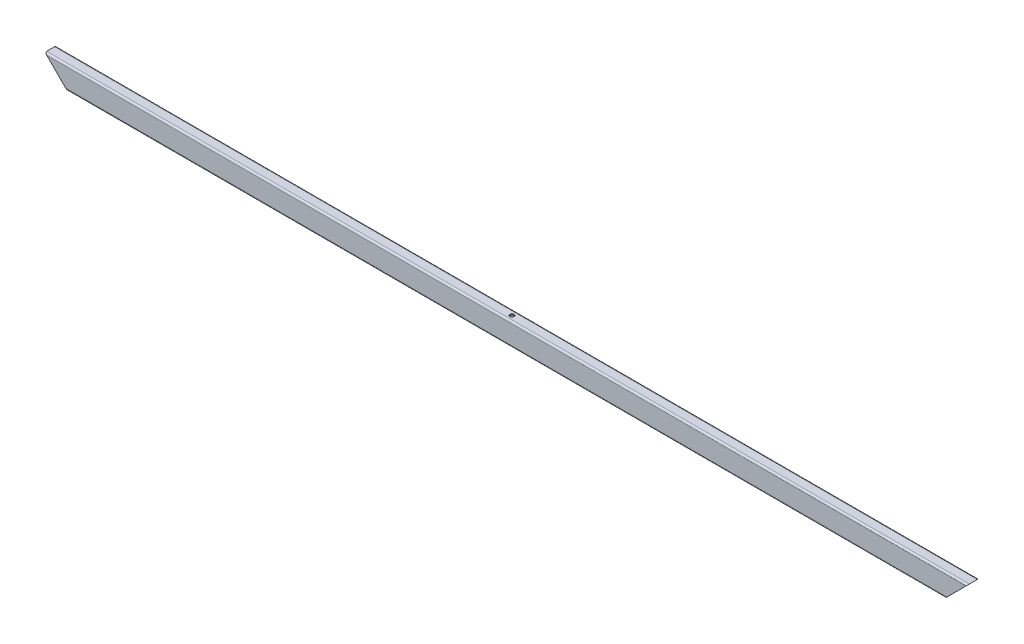
ISO-10303-21;
HEADER;
FILE_DESCRIPTION(('STEP AP214'),'2;1');
FILE_NAME('part.step','',(''),(''),'','','');
FILE_SCHEMA(('AUTOMOTIVE_DESIGN { 1 0 10303 214 1 1 1 1 }'));
ENDSEC;
DATA;
#1=APPLICATION_CONTEXT('core data for automotive mechanical design processes');
#2=APPLICATION_PROTOCOL_DEFINITION('international standard','automotive_design',2000,#1);
#3=PRODUCT_CONTEXT('',#1,'mechanical');
#4=PRODUCT('Part','Part','',(#3));
#5=PRODUCT_RELATED_PRODUCT_CATEGORY('part','',(#4));
#6=PRODUCT_DEFINITION_FORMATION('','',#4);
#7=PRODUCT_DEFINITION_CONTEXT('part definition',#1,'design');
#8=PRODUCT_DEFINITION('design','',#6,#7);
#9=PRODUCT_DEFINITION_SHAPE('','',#8);
#10=(LENGTH_UNIT() NAMED_UNIT(*) SI_UNIT(.MILLI.,.METRE.));
#11=(NAMED_UNIT(*) PLANE_ANGLE_UNIT() SI_UNIT($,.RADIAN.));
#12=(NAMED_UNIT(*) SI_UNIT($,.STERADIAN.) SOLID_ANGLE_UNIT());
#13=UNCERTAINTY_MEASURE_WITH_UNIT(LENGTH_MEASURE(1.E-05),#10,'distance_accuracy_value','');
#14=(GEOMETRIC_REPRESENTATION_CONTEXT(3) GLOBAL_UNCERTAINTY_ASSIGNED_CONTEXT((#13)) GLOBAL_UNIT_ASSIGNED_CONTEXT((#10,
#11,#12)) REPRESENTATION_CONTEXT('',''));
#15=CARTESIAN_POINT('',(0.,0.,0.));
#16=DIRECTION('',(0.,0.,1.));
#17=DIRECTION('',(1.,0.,0.));
#18=AXIS2_PLACEMENT_3D('',#15,#16,#17);
#19=CARTESIAN_POINT('',(801.999999999999,1104.,112.));
#20=DIRECTION('',(0.,1.,0.));
#21=DIRECTION('',(-1.,0.,0.));
#22=AXIS2_PLACEMENT_3D('',#19,#20,#21);
#23=PLANE('',#22);
#24=CARTESIAN_POINT('',(400.,1104.,119.));
#25=DIRECTION('',(0.,-1.,0.));
#26=DIRECTION('',(0.,0.,-1.));
#27=AXIS2_PLACEMENT_3D('',#24,#25,#26);
#28=CIRCLE('',#27,1.64999999999998);
#29=CARTESIAN_POINT('',(400.,1104.,117.35));
#30=VERTEX_POINT('',#29);
#31=EDGE_CURVE('E245',#30,#30,#28,.T.);
#32=ORIENTED_EDGE('',*,*,#31,.F.);
#33=EDGE_LOOP('',(#32));
#34=FACE_BOUND('',#33,.T.);
#35=CARTESIAN_POINT('',(150.,1104.,119.));
#36=DIRECTION('',(0.,-1.,0.));
#37=DIRECTION('',(0.,0.,-1.));
#38=AXIS2_PLACEMENT_3D('',#35,#36,#37);
#39=CIRCLE('',#38,1.65000000000001);
#40=CARTESIAN_POINT('',(150.,1104.,117.35));
#41=VERTEX_POINT('',#40);
#42=EDGE_CURVE('E235',#41,#41,#39,.T.);
#43=ORIENTED_EDGE('',*,*,#42,.F.);
#44=EDGE_LOOP('',(#43));
#45=FACE_BOUND('',#44,.T.);
#46=CARTESIAN_POINT('',(650.,1104.,119.));
#47=DIRECTION('',(0.,-1.,0.));
#48=DIRECTION('',(0.,0.,-1.));
#49=AXIS2_PLACEMENT_3D('',#46,#47,#48);
#50=CIRCLE('',#49,1.65000000000004);
#51=CARTESIAN_POINT('',(650.,1104.,117.35));
#52=VERTEX_POINT('',#51);
#53=EDGE_CURVE('E229',#52,#52,#50,.T.);
#54=ORIENTED_EDGE('',*,*,#53,.F.);
#55=EDGE_LOOP('',(#54));
#56=FACE_BOUND('',#55,.T.);
#57=CARTESIAN_POINT('',(-650.,1104.,119.));
#58=DIRECTION('',(0.,-1.,0.));
#59=DIRECTION('',(0.,0.,-1.));
#60=AXIS2_PLACEMENT_3D('',#57,#58,#59);
#61=CIRCLE('',#60,1.65000000000004);
#62=CARTESIAN_POINT('',(-650.,1104.,117.35));
#63=VERTEX_POINT('',#62);
#64=EDGE_CURVE('E225',#63,#63,#61,.T.);
#65=ORIENTED_EDGE('',*,*,#64,.F.);
#66=EDGE_LOOP('',(#65));
#67=FACE_BOUND('',#66,.T.);
#68=CARTESIAN_POINT('',(-400.,1104.,119.));
#69=DIRECTION('',(0.,-1.,0.));
#70=DIRECTION('',(0.,0.,-1.));
#71=AXIS2_PLACEMENT_3D('',#68,#69,#70);
#72=CIRCLE('',#71,1.64999999999998);
#73=CARTESIAN_POINT('',(-400.,1104.,117.35));
#74=VERTEX_POINT('',#73);
#75=EDGE_CURVE('E224',#74,#74,#72,.T.);
#76=ORIENTED_EDGE('',*,*,#75,.F.);
#77=EDGE_LOOP('',(#76));
#78=FACE_BOUND('',#77,.T.);
#79=DIRECTION('',(-1.,0.,0.));
#80=VECTOR('',#79,1.);
#81=CARTESIAN_POINT('',(801.999999999999,1104.,112.));
#82=LINE('',#81,#80);
#83=CARTESIAN_POINT('',(781.999999999999,1104.,112.));
#84=VERTEX_POINT('',#83);
#85=CARTESIAN_POINT('',(-782.,1104.,112.));
#86=VERTEX_POINT('',#85);
#87=EDGE_CURVE('E185',#84,#86,#82,.T.);
#88=ORIENTED_EDGE('',*,*,#87,.F.);
#89=DIRECTION('',(0.,0.,1.));
#90=VECTOR('',#89,1.);
#91=CARTESIAN_POINT('',(781.999999999999,1104.,112.));
#92=LINE('',#91,#90);
#93=CARTESIAN_POINT('',(781.999999999999,1104.,126.));
#94=VERTEX_POINT('',#93);
#95=EDGE_CURVE('E184',#84,#94,#92,.T.);
#96=ORIENTED_EDGE('',*,*,#95,.T.);
#97=DIRECTION('',(-1.,0.,0.));
#98=VECTOR('',#97,1.);
#99=CARTESIAN_POINT('',(801.999999999999,1104.,126.));
#100=LINE('',#99,#98);
#101=CARTESIAN_POINT('',(-781.999999999999,1104.,126.));
#102=VERTEX_POINT('',#101);
#103=EDGE_CURVE('E181',#94,#102,#100,.T.);
#104=ORIENTED_EDGE('',*,*,#103,.T.);
#105=DIRECTION('',(0.,0.,-1.));
#106=VECTOR('',#105,1.);
#107=CARTESIAN_POINT('',(-782.,1104.,112.));
#108=LINE('',#107,#106);
#109=EDGE_CURVE('E183',#102,#86,#108,.T.);
#110=ORIENTED_EDGE('',*,*,#109,.T.);
#111=EDGE_LOOP('',(#88,#96,#104,#110));
#112=FACE_BOUND('',#111,.T.);
#113=CARTESIAN_POINT('',(-150.,1104.,119.));
#114=DIRECTION('',(0.,-1.,0.));
#115=DIRECTION('',(0.,0.,-1.));
#116=AXIS2_PLACEMENT_3D('',#113,#114,#115);
#117=CIRCLE('',#116,1.65000000000001);
#118=CARTESIAN_POINT('',(-150.,1104.,117.35));
#119=VERTEX_POINT('',#118);
#120=EDGE_CURVE('E232',#119,#119,#117,.T.);
#121=ORIENTED_EDGE('',*,*,#120,.F.);
#122=EDGE_LOOP('',(#121));
#123=FACE_BOUND('',#122,.T.);
#124=ADVANCED_FACE('F36',(#34,#45,#56,#67,#78,#112,#123),#23,.F.);
#125=CARTESIAN_POINT('',(801.999999999999,1141.,129.));
#126=DIRECTION('',(0.,0.,-1.));
#127=DIRECTION('',(-1.,0.,0.));
#128=AXIS2_PLACEMENT_3D('',#125,#126,#127);
#129=PLANE('',#128);
#130=DIRECTION('',(-1.,0.,0.));
#131=VECTOR('',#130,1.);
#132=CARTESIAN_POINT('',(801.999999999999,1107.,129.));
#133=LINE('',#132,#131);
#134=CARTESIAN_POINT('',(784.999999999999,1107.,129.));
#135=VERTEX_POINT('',#134);
#136=CARTESIAN_POINT('',(-784.999999999999,1107.,129.));
#137=VERTEX_POINT('',#136);
#138=EDGE_CURVE('E178',#135,#137,#133,.T.);
#139=ORIENTED_EDGE('',*,*,#138,.F.);
#140=DIRECTION('',(0.707106781186547,0.707106781186548,0.));
#141=VECTOR('',#140,1.);
#142=CARTESIAN_POINT('',(810.499999999999,1132.5,129.));
#143=LINE('',#142,#141);
#144=CARTESIAN_POINT('',(819.,1141.,129.));
#145=VERTEX_POINT('',#144);
#146=EDGE_CURVE('E55',#135,#145,#143,.T.);
#147=ORIENTED_EDGE('',*,*,#146,.T.);
#148=DIRECTION('',(-1.,0.,0.));
#149=VECTOR('',#148,1.);
#150=CARTESIAN_POINT('',(801.999999999999,1141.,129.));
#151=LINE('',#150,#149);
#152=CARTESIAN_POINT('',(-819.,1141.,129.));
#153=VERTEX_POINT('',#152);
#154=EDGE_CURVE('E150',#145,#153,#151,.T.);
#155=ORIENTED_EDGE('',*,*,#154,.T.);
#156=DIRECTION('',(0.707106781186548,-0.707106781186547,0.));
#157=VECTOR('',#156,1.);
#158=CARTESIAN_POINT('',(-8.50000000000017,330.500000000001,129.));
#159=LINE('',#158,#157);
#160=EDGE_CURVE('E135',#153,#137,#159,.T.);
#161=ORIENTED_EDGE('',*,*,#160,.T.);
#162=EDGE_LOOP('',(#139,#147,#155,#161));
#163=FACE_BOUND('',#162,.T.);
#164=ADVANCED_FACE('F317',(#163),#129,.F.);
#165=CARTESIAN_POINT('',(801.999999999999,1141.,126.));
#166=DIRECTION('',(-1.,0.,0.));
#167=DIRECTION('',(0.,-1.,0.));
#168=AXIS2_PLACEMENT_3D('',#165,#166,#167);
#169=CYLINDRICAL_SURFACE('',#168,3.);
#170=ORIENTED_EDGE('',*,*,#154,.F.);
#171=CARTESIAN_POINT('',(819.,1141.,126.));
#172=DIRECTION('',(-0.707106781186548,0.707106781186547,0.));
#173=DIRECTION('',(-0.707106781186547,-0.707106781186548,0.));
#174=AXIS2_PLACEMENT_3D('',#171,#172,#173);
#175=ELLIPSE('',#174,4.24264068711929,3.);
#176=CARTESIAN_POINT('',(821.999999999999,1144.,126.));
#177=VERTEX_POINT('',#176);
#178=EDGE_CURVE('E125',#145,#177,#175,.T.);
#179=ORIENTED_EDGE('',*,*,#178,.T.);
#180=DIRECTION('',(-1.,0.,0.));
#181=VECTOR('',#180,1.);
#182=CARTESIAN_POINT('',(801.999999999999,1144.,126.));
#183=LINE('',#182,#181);
#184=CARTESIAN_POINT('',(-821.999999999999,1144.,126.));
#185=VERTEX_POINT('',#184);
#186=EDGE_CURVE('E120',#177,#185,#183,.T.);
#187=ORIENTED_EDGE('',*,*,#186,.T.);
#188=CARTESIAN_POINT('',(-819.,1141.,126.));
#189=DIRECTION('',(0.707106781186547,0.707106781186548,0.));
#190=DIRECTION('',(-0.707106781186548,0.707106781186547,0.));
#191=AXIS2_PLACEMENT_3D('',#188,#189,#190);
#192=ELLIPSE('',#191,4.24264068711929,3.);
#193=EDGE_CURVE('E124',#185,#153,#192,.T.);
#194=ORIENTED_EDGE('',*,*,#193,.T.);
#195=EDGE_LOOP('',(#170,#179,#187,#194));
#196=FACE_BOUND('',#195,.T.);
#197=ADVANCED_FACE('F123',(#196),#169,.T.);
#198=CARTESIAN_POINT('',(801.999999999999,1144.,112.));
#199=DIRECTION('',(0.,-1.,0.));
#200=DIRECTION('',(1.,0.,0.));
#201=AXIS2_PLACEMENT_3D('',#198,#199,#200);
#202=PLANE('',#201);
#203=CARTESIAN_POINT('',(0.,1144.,119.));
#204=DIRECTION('',(0.,1.,0.));
#205=DIRECTION('',(0.,0.,1.));
#206=AXIS2_PLACEMENT_3D('',#203,#204,#205);
#207=CIRCLE('',#206,3.59999999999999);
#208=CARTESIAN_POINT('',(0.,1144.,122.6));
#209=VERTEX_POINT('',#208);
#210=EDGE_CURVE('E257',#209,#209,#207,.T.);
#211=ORIENTED_EDGE('',*,*,#210,.F.);
#212=EDGE_LOOP('',(#211));
#213=FACE_BOUND('',#212,.T.);
#214=ORIENTED_EDGE('',*,*,#186,.F.);
#215=DIRECTION('',(0.,0.,-1.));
#216=VECTOR('',#215,1.);
#217=CARTESIAN_POINT('',(821.999999999999,1144.,112.));
#218=LINE('',#217,#216);
#219=CARTESIAN_POINT('',(821.999999999999,1144.,112.));
#220=VERTEX_POINT('',#219);
#221=EDGE_CURVE('E136',#177,#220,#218,.T.);
#222=ORIENTED_EDGE('',*,*,#221,.T.);
#223=DIRECTION('',(-1.,0.,0.));
#224=VECTOR('',#223,1.);
#225=CARTESIAN_POINT('',(801.999999999999,1144.,112.));
#226=LINE('',#225,#224);
#227=CARTESIAN_POINT('',(-821.999999999999,1144.,112.));
#228=VERTEX_POINT('',#227);
#229=EDGE_CURVE('E113',#220,#228,#226,.T.);
#230=ORIENTED_EDGE('',*,*,#229,.T.);
#231=DIRECTION('',(0.,0.,1.));
#232=VECTOR('',#231,1.);
#233=CARTESIAN_POINT('',(-821.999999999999,1144.,112.));
#234=LINE('',#233,#232);
#235=EDGE_CURVE('E131',#228,#185,#234,.T.);
#236=ORIENTED_EDGE('',*,*,#235,.T.);
#237=EDGE_LOOP('',(#214,#222,#230,#236));
#238=FACE_BOUND('',#237,.T.);
#239=ADVANCED_FACE('F138',(#213,#238),#202,.F.);
#240=CARTESIAN_POINT('',(801.999999999999,1141.,112.));
#241=DIRECTION('',(-1.,0.,0.));
#242=DIRECTION('',(0.,-1.,0.));
#243=AXIS2_PLACEMENT_3D('',#240,#241,#242);
#244=CYLINDRICAL_SURFACE('',#243,3.);
#245=ORIENTED_EDGE('',*,*,#229,.F.);
#246=CARTESIAN_POINT('',(819.,1141.,112.));
#247=DIRECTION('',(-0.707106781186548,0.707106781186547,0.));
#248=DIRECTION('',(-0.707106781186547,-0.707106781186548,0.));
#249=AXIS2_PLACEMENT_3D('',#246,#247,#248);
#250=ELLIPSE('',#249,4.24264068711929,3.);
#251=CARTESIAN_POINT('',(819.,1141.,109.));
#252=VERTEX_POINT('',#251);
#253=EDGE_CURVE('E139',#220,#252,#250,.T.);
#254=ORIENTED_EDGE('',*,*,#253,.T.);
#255=DIRECTION('',(-1.,0.,0.));
#256=VECTOR('',#255,1.);
#257=CARTESIAN_POINT('',(801.999999999999,1141.,109.));
#258=LINE('',#257,#256);
#259=CARTESIAN_POINT('',(-819.,1141.,109.));
#260=VERTEX_POINT('',#259);
#261=EDGE_CURVE('E142',#252,#260,#258,.T.);
#262=ORIENTED_EDGE('',*,*,#261,.T.);
#263=CARTESIAN_POINT('',(-819.,1141.,112.));
#264=DIRECTION('',(0.707106781186547,0.707106781186548,0.));
#265=DIRECTION('',(-0.707106781186548,0.707106781186547,0.));
#266=AXIS2_PLACEMENT_3D('',#263,#264,#265);
#267=ELLIPSE('',#266,4.24264068711929,3.);
#268=EDGE_CURVE('E146',#260,#228,#267,.T.);
#269=ORIENTED_EDGE('',*,*,#268,.T.);
#270=EDGE_LOOP('',(#245,#254,#262,#269));
#271=FACE_BOUND('',#270,.T.);
#272=ADVANCED_FACE('F343',(#271),#244,.T.);
#273=CARTESIAN_POINT('',(801.999999999999,1141.,109.));
#274=DIRECTION('',(0.,0.,1.));
#275=DIRECTION('',(1.,0.,0.));
#276=AXIS2_PLACEMENT_3D('',#273,#274,#275);
#277=PLANE('',#276);
#278=ORIENTED_EDGE('',*,*,#261,.F.);
#279=DIRECTION('',(-0.707106781186547,-0.707106781186548,0.));
#280=VECTOR('',#279,1.);
#281=CARTESIAN_POINT('',(810.499999999999,1132.5,109.));
#282=LINE('',#281,#280);
#283=CARTESIAN_POINT('',(784.999999999999,1107.,109.));
#284=VERTEX_POINT('',#283);
#285=EDGE_CURVE('E192',#252,#284,#282,.T.);
#286=ORIENTED_EDGE('',*,*,#285,.T.);
#287=DIRECTION('',(-1.,0.,0.));
#288=VECTOR('',#287,1.);
#289=CARTESIAN_POINT('',(801.999999999999,1107.,109.));
#290=LINE('',#289,#288);
#291=CARTESIAN_POINT('',(-784.999999999999,1107.,109.));
#292=VERTEX_POINT('',#291);
#293=EDGE_CURVE('E189',#284,#292,#290,.T.);
#294=ORIENTED_EDGE('',*,*,#293,.T.);
#295=DIRECTION('',(-0.707106781186548,0.707106781186547,0.));
#296=VECTOR('',#295,1.);
#297=CARTESIAN_POINT('',(-8.50000000000017,330.500000000001,109.));
#298=LINE('',#297,#296);
#299=EDGE_CURVE('E191',#292,#260,#298,.T.);
#300=ORIENTED_EDGE('',*,*,#299,.T.);
#301=EDGE_LOOP('',(#278,#286,#294,#300));
#302=FACE_BOUND('',#301,.T.);
#303=ADVANCED_FACE('F290',(#302),#277,.F.);
#304=CARTESIAN_POINT('',(801.999999999999,1107.,112.));
#305=DIRECTION('',(-1.,0.,0.));
#306=DIRECTION('',(0.,-1.,0.));
#307=AXIS2_PLACEMENT_3D('',#304,#305,#306);
#308=CYLINDRICAL_SURFACE('',#307,3.);
#309=ORIENTED_EDGE('',*,*,#293,.F.);
#310=CARTESIAN_POINT('',(784.999999999999,1107.,112.));
#311=DIRECTION('',(-0.707106781186548,0.707106781186547,0.));
#312=DIRECTION('',(-0.707106781186547,-0.707106781186548,0.));
#313=AXIS2_PLACEMENT_3D('',#310,#311,#312);
#314=ELLIPSE('',#313,4.24264068711929,3.);
#315=EDGE_CURVE('E188',#284,#84,#314,.T.);
#316=ORIENTED_EDGE('',*,*,#315,.T.);
#317=ORIENTED_EDGE('',*,*,#87,.T.);
#318=CARTESIAN_POINT('',(-784.999999999999,1107.,112.));
#319=DIRECTION('',(0.707106781186547,0.707106781186548,0.));
#320=DIRECTION('',(-0.707106781186548,0.707106781186547,0.));
#321=AXIS2_PLACEMENT_3D('',#318,#319,#320);
#322=ELLIPSE('',#321,4.24264068711929,3.);
#323=EDGE_CURVE('E187',#86,#292,#322,.T.);
#324=ORIENTED_EDGE('',*,*,#323,.T.);
#325=EDGE_LOOP('',(#309,#316,#317,#324));
#326=FACE_BOUND('',#325,.T.);
#327=ADVANCED_FACE('F296',(#326),#308,.T.);
#328=CARTESIAN_POINT('',(801.999999999999,1107.,126.));
#329=DIRECTION('',(-1.,0.,0.));
#330=DIRECTION('',(0.,-1.,0.));
#331=AXIS2_PLACEMENT_3D('',#328,#329,#330);
#332=CYLINDRICAL_SURFACE('',#331,3.);
#333=ORIENTED_EDGE('',*,*,#103,.F.);
#334=CARTESIAN_POINT('',(784.999999999999,1107.,126.));
#335=DIRECTION('',(-0.707106781186548,0.707106781186547,0.));
#336=DIRECTION('',(-0.707106781186547,-0.707106781186548,0.));
#337=AXIS2_PLACEMENT_3D('',#334,#335,#336);
#338=ELLIPSE('',#337,4.24264068711929,3.);
#339=EDGE_CURVE('E180',#94,#135,#338,.T.);
#340=ORIENTED_EDGE('',*,*,#339,.T.);
#341=ORIENTED_EDGE('',*,*,#138,.T.);
#342=CARTESIAN_POINT('',(-784.999999999999,1107.,126.));
#343=DIRECTION('',(0.707106781186547,0.707106781186548,0.));
#344=DIRECTION('',(-0.707106781186548,0.707106781186547,0.));
#345=AXIS2_PLACEMENT_3D('',#342,#343,#344);
#346=ELLIPSE('',#345,4.24264068711929,3.);
#347=EDGE_CURVE('E177',#137,#102,#346,.T.);
#348=ORIENTED_EDGE('',*,*,#347,.T.);
#349=EDGE_LOOP('',(#333,#340,#341,#348));
#350=FACE_BOUND('',#349,.T.);
#351=ADVANCED_FACE('F319',(#350),#332,.T.);
#352=CARTESIAN_POINT('',(801.999999999999,1142.,112.));
#353=DIRECTION('',(0.,-1.,0.));
#354=DIRECTION('',(1.,0.,0.));
#355=AXIS2_PLACEMENT_3D('',#352,#353,#354);
#356=PLANE('',#355);
#357=CARTESIAN_POINT('',(0.,1142.,119.));
#358=DIRECTION('',(0.,-1.,0.));
#359=DIRECTION('',(1.,0.,0.));
#360=AXIS2_PLACEMENT_3D('',#357,#358,#359);
#361=CIRCLE('',#360,3.59999999999999);
#362=CARTESIAN_POINT('',(3.59999999999999,1142.,119.));
#363=VERTEX_POINT('',#362);
#364=EDGE_CURVE('E196',#363,#363,#361,.T.);
#365=ORIENTED_EDGE('',*,*,#364,.F.);
#366=EDGE_LOOP('',(#365));
#367=FACE_BOUND('',#366,.T.);
#368=DIRECTION('',(0.,0.,-1.));
#369=VECTOR('',#368,1.);
#370=CARTESIAN_POINT('',(819.999999999999,1142.,112.));
#371=LINE('',#370,#369);
#372=CARTESIAN_POINT('',(819.999999999999,1142.,126.));
#373=VERTEX_POINT('',#372);
#374=CARTESIAN_POINT('',(819.999999999999,1142.,112.));
#375=VERTEX_POINT('',#374);
#376=EDGE_CURVE('E154',#373,#375,#371,.T.);
#377=ORIENTED_EDGE('',*,*,#376,.F.);
#378=DIRECTION('',(-1.,0.,0.));
#379=VECTOR('',#378,1.);
#380=CARTESIAN_POINT('',(801.999999999999,1142.,126.));
#381=LINE('',#380,#379);
#382=CARTESIAN_POINT('',(-819.999999999999,1142.,126.));
#383=VERTEX_POINT('',#382);
#384=EDGE_CURVE('E175',#373,#383,#381,.T.);
#385=ORIENTED_EDGE('',*,*,#384,.T.);
#386=DIRECTION('',(0.,0.,1.));
#387=VECTOR('',#386,1.);
#388=CARTESIAN_POINT('',(-820.,1142.,112.));
#389=LINE('',#388,#387);
#390=CARTESIAN_POINT('',(-819.999999999999,1142.,112.));
#391=VERTEX_POINT('',#390);
#392=EDGE_CURVE('E162',#391,#383,#389,.T.);
#393=ORIENTED_EDGE('',*,*,#392,.F.);
#394=DIRECTION('',(-1.,0.,0.));
#395=VECTOR('',#394,1.);
#396=CARTESIAN_POINT('',(801.999999999999,1142.,112.));
#397=LINE('',#396,#395);
#398=EDGE_CURVE('E160',#375,#391,#397,.T.);
#399=ORIENTED_EDGE('',*,*,#398,.F.);
#400=EDGE_LOOP('',(#377,#385,#393,#399));
#401=FACE_BOUND('',#400,.T.);
#402=ADVANCED_FACE('F321',(#367,#401),#356,.T.);
#403=CARTESIAN_POINT('',(801.999999999999,1141.,126.));
#404=DIRECTION('',(-1.,0.,0.));
#405=DIRECTION('',(0.,-1.,0.));
#406=AXIS2_PLACEMENT_3D('',#403,#404,#405);
#407=CYLINDRICAL_SURFACE('',#406,1.);
#408=CARTESIAN_POINT('',(819.,1141.,126.));
#409=DIRECTION('',(-0.707106781186548,0.707106781186547,0.));
#410=DIRECTION('',(-0.707106781186547,-0.707106781186548,0.));
#411=AXIS2_PLACEMENT_3D('',#408,#409,#410);
#412=ELLIPSE('',#411,1.4142135623731,1.);
#413=CARTESIAN_POINT('',(819.000000000001,1141.,127.));
#414=VERTEX_POINT('',#413);
#415=EDGE_CURVE('E11',#414,#373,#412,.T.);
#416=ORIENTED_EDGE('',*,*,#415,.F.);
#417=DIRECTION('',(-1.,0.,0.));
#418=VECTOR('',#417,1.);
#419=CARTESIAN_POINT('',(801.999999999999,1141.,127.));
#420=LINE('',#419,#418);
#421=CARTESIAN_POINT('',(-819.,1141.,127.));
#422=VERTEX_POINT('',#421);
#423=EDGE_CURVE('E173',#414,#422,#420,.T.);
#424=ORIENTED_EDGE('',*,*,#423,.T.);
#425=CARTESIAN_POINT('',(-819.,1141.,126.));
#426=DIRECTION('',(0.707106781186547,0.707106781186548,0.));
#427=DIRECTION('',(-0.707106781186548,0.707106781186547,0.));
#428=AXIS2_PLACEMENT_3D('',#425,#426,#427);
#429=ELLIPSE('',#428,1.4142135623731,1.);
#430=EDGE_CURVE('E276',#383,#422,#429,.T.);
#431=ORIENTED_EDGE('',*,*,#430,.F.);
#432=ORIENTED_EDGE('',*,*,#384,.F.);
#433=EDGE_LOOP('',(#416,#424,#431,#432));
#434=FACE_BOUND('',#433,.T.);
#435=ADVANCED_FACE('F327',(#434),#407,.F.);
#436=CARTESIAN_POINT('',(801.999999999999,1141.,127.));
#437=DIRECTION('',(0.,0.,-1.));
#438=DIRECTION('',(-1.,0.,0.));
#439=AXIS2_PLACEMENT_3D('',#436,#437,#438);
#440=PLANE('',#439);
#441=DIRECTION('',(0.707106781186547,0.707106781186548,0.));
#442=VECTOR('',#441,1.);
#443=CARTESIAN_POINT('',(810.499999999999,1132.5,127.));
#444=LINE('',#443,#442);
#445=CARTESIAN_POINT('',(784.999999999999,1107.,127.));
#446=VERTEX_POINT('',#445);
#447=EDGE_CURVE('E46',#446,#414,#444,.T.);
#448=ORIENTED_EDGE('',*,*,#447,.F.);
#449=DIRECTION('',(-1.,0.,0.));
#450=VECTOR('',#449,1.);
#451=CARTESIAN_POINT('',(801.999999999999,1107.,127.));
#452=LINE('',#451,#450);
#453=CARTESIAN_POINT('',(-784.999999999999,1107.,127.));
#454=VERTEX_POINT('',#453);
#455=EDGE_CURVE('E171',#446,#454,#452,.T.);
#456=ORIENTED_EDGE('',*,*,#455,.T.);
#457=DIRECTION('',(0.707106781186548,-0.707106781186547,0.));
#458=VECTOR('',#457,1.);
#459=CARTESIAN_POINT('',(-8.50000000000017,330.500000000001,127.));
#460=LINE('',#459,#458);
#461=EDGE_CURVE('E273',#422,#454,#460,.T.);
#462=ORIENTED_EDGE('',*,*,#461,.F.);
#463=ORIENTED_EDGE('',*,*,#423,.F.);
#464=EDGE_LOOP('',(#448,#456,#462,#463));
#465=FACE_BOUND('',#464,.T.);
#466=ADVANCED_FACE('F371',(#465),#440,.T.);
#467=CARTESIAN_POINT('',(801.999999999999,1107.,126.));
#468=DIRECTION('',(-1.,0.,0.));
#469=DIRECTION('',(0.,-1.,0.));
#470=AXIS2_PLACEMENT_3D('',#467,#468,#469);
#471=CYLINDRICAL_SURFACE('',#470,1.);
#472=CARTESIAN_POINT('',(784.999999999999,1107.,126.));
#473=DIRECTION('',(-0.707106781186548,0.707106781186547,0.));
#474=DIRECTION('',(-0.707106781186547,-0.707106781186548,0.));
#475=AXIS2_PLACEMENT_3D('',#472,#473,#474);
#476=ELLIPSE('',#475,1.4142135623731,1.);
#477=CARTESIAN_POINT('',(783.999999999999,1106.,126.));
#478=VERTEX_POINT('',#477);
#479=EDGE_CURVE('E210',#478,#446,#476,.T.);
#480=ORIENTED_EDGE('',*,*,#479,.F.);
#481=DIRECTION('',(-1.,0.,0.));
#482=VECTOR('',#481,1.);
#483=CARTESIAN_POINT('',(801.999999999999,1106.,126.));
#484=LINE('',#483,#482);
#485=CARTESIAN_POINT('',(-784.,1106.,126.));
#486=VERTEX_POINT('',#485);
#487=EDGE_CURVE('E169',#478,#486,#484,.T.);
#488=ORIENTED_EDGE('',*,*,#487,.T.);
#489=CARTESIAN_POINT('',(-784.999999999999,1107.,126.));
#490=DIRECTION('',(0.707106781186547,0.707106781186548,0.));
#491=DIRECTION('',(-0.707106781186548,0.707106781186547,0.));
#492=AXIS2_PLACEMENT_3D('',#489,#490,#491);
#493=ELLIPSE('',#492,1.4142135623731,1.);
#494=EDGE_CURVE('E270',#454,#486,#493,.T.);
#495=ORIENTED_EDGE('',*,*,#494,.F.);
#496=ORIENTED_EDGE('',*,*,#455,.F.);
#497=EDGE_LOOP('',(#480,#488,#495,#496));
#498=FACE_BOUND('',#497,.T.);
#499=ADVANCED_FACE('F367',(#498),#471,.F.);
#500=CARTESIAN_POINT('',(801.999999999999,1106.,112.));
#501=DIRECTION('',(0.,1.,0.));
#502=DIRECTION('',(-1.,0.,0.));
#503=AXIS2_PLACEMENT_3D('',#500,#501,#502);
#504=PLANE('',#503);
#505=CARTESIAN_POINT('',(400.,1106.,119.));
#506=DIRECTION('',(0.,1.,0.));
#507=DIRECTION('',(-1.,0.,0.));
#508=AXIS2_PLACEMENT_3D('',#505,#506,#507);
#509=CIRCLE('',#508,1.64999999999998);
#510=CARTESIAN_POINT('',(398.35,1106.,119.));
#511=VERTEX_POINT('',#510);
#512=EDGE_CURVE('E40',#511,#511,#509,.T.);
#513=ORIENTED_EDGE('',*,*,#512,.F.);
#514=EDGE_LOOP('',(#513));
#515=FACE_BOUND('',#514,.T.);
#516=CARTESIAN_POINT('',(150.,1106.,119.));
#517=DIRECTION('',(0.,1.,0.));
#518=DIRECTION('',(-1.,0.,0.));
#519=AXIS2_PLACEMENT_3D('',#516,#517,#518);
#520=CIRCLE('',#519,1.65);
#521=CARTESIAN_POINT('',(148.35,1106.,119.));
#522=VERTEX_POINT('',#521);
#523=EDGE_CURVE('E233',#522,#522,#520,.T.);
#524=ORIENTED_EDGE('',*,*,#523,.F.);
#525=EDGE_LOOP('',(#524));
#526=FACE_BOUND('',#525,.T.);
#527=CARTESIAN_POINT('',(-150.,1106.,119.));
#528=DIRECTION('',(0.,1.,0.));
#529=DIRECTION('',(-1.,0.,0.));
#530=AXIS2_PLACEMENT_3D('',#527,#528,#529);
#531=CIRCLE('',#530,1.65);
#532=CARTESIAN_POINT('',(-151.65,1106.,119.));
#533=VERTEX_POINT('',#532);
#534=EDGE_CURVE('E230',#533,#533,#531,.T.);
#535=ORIENTED_EDGE('',*,*,#534,.F.);
#536=EDGE_LOOP('',(#535));
#537=FACE_BOUND('',#536,.T.);
#538=CARTESIAN_POINT('',(650.,1106.,119.));
#539=DIRECTION('',(0.,1.,0.));
#540=DIRECTION('',(-1.,0.,0.));
#541=AXIS2_PLACEMENT_3D('',#538,#539,#540);
#542=CIRCLE('',#541,1.65000000000004);
#543=CARTESIAN_POINT('',(648.35,1106.,119.));
#544=VERTEX_POINT('',#543);
#545=EDGE_CURVE('E226',#544,#544,#542,.T.);
#546=ORIENTED_EDGE('',*,*,#545,.F.);
#547=EDGE_LOOP('',(#546));
#548=FACE_BOUND('',#547,.T.);
#549=CARTESIAN_POINT('',(-650.,1106.,119.));
#550=DIRECTION('',(0.,1.,0.));
#551=DIRECTION('',(-1.,0.,0.));
#552=AXIS2_PLACEMENT_3D('',#549,#550,#551);
#553=CIRCLE('',#552,1.65000000000004);
#554=CARTESIAN_POINT('',(-651.65,1106.,119.));
#555=VERTEX_POINT('',#554);
#556=EDGE_CURVE('E221',#555,#555,#553,.T.);
#557=ORIENTED_EDGE('',*,*,#556,.F.);
#558=EDGE_LOOP('',(#557));
#559=FACE_BOUND('',#558,.T.);
#560=CARTESIAN_POINT('',(-400.,1106.,119.));
#561=DIRECTION('',(0.,1.,0.));
#562=DIRECTION('',(-1.,0.,0.));
#563=AXIS2_PLACEMENT_3D('',#560,#561,#562);
#564=CIRCLE('',#563,1.64999999999998);
#565=CARTESIAN_POINT('',(-401.65,1106.,119.));
#566=VERTEX_POINT('',#565);
#567=EDGE_CURVE('E254',#566,#566,#564,.T.);
#568=ORIENTED_EDGE('',*,*,#567,.F.);
#569=EDGE_LOOP('',(#568));
#570=FACE_BOUND('',#569,.T.);
#571=DIRECTION('',(0.,0.,1.));
#572=VECTOR('',#571,1.);
#573=CARTESIAN_POINT('',(783.999999999999,1106.,112.));
#574=LINE('',#573,#572);
#575=CARTESIAN_POINT('',(783.999999999999,1106.,112.));
#576=VERTEX_POINT('',#575);
#577=EDGE_CURVE('E213',#576,#478,#574,.T.);
#578=ORIENTED_EDGE('',*,*,#577,.F.);
#579=DIRECTION('',(-1.,0.,0.));
#580=VECTOR('',#579,1.);
#581=CARTESIAN_POINT('',(801.999999999999,1106.,112.));
#582=LINE('',#581,#580);
#583=CARTESIAN_POINT('',(-783.999999999999,1106.,112.));
#584=VERTEX_POINT('',#583);
#585=EDGE_CURVE('E167',#576,#584,#582,.T.);
#586=ORIENTED_EDGE('',*,*,#585,.T.);
#587=DIRECTION('',(0.,0.,-1.));
#588=VECTOR('',#587,1.);
#589=CARTESIAN_POINT('',(-784.,1106.,112.));
#590=LINE('',#589,#588);
#591=EDGE_CURVE('E267',#486,#584,#590,.T.);
#592=ORIENTED_EDGE('',*,*,#591,.F.);
#593=ORIENTED_EDGE('',*,*,#487,.F.);
#594=EDGE_LOOP('',(#578,#586,#592,#593));
#595=FACE_BOUND('',#594,.T.);
#596=ADVANCED_FACE('F363',(#515,#526,#537,#548,#559,#570,#595),#504,.T.);
#597=CARTESIAN_POINT('',(801.999999999999,1107.,112.));
#598=DIRECTION('',(-1.,0.,0.));
#599=DIRECTION('',(0.,-1.,0.));
#600=AXIS2_PLACEMENT_3D('',#597,#598,#599);
#601=CYLINDRICAL_SURFACE('',#600,1.);
#602=CARTESIAN_POINT('',(784.999999999999,1107.,112.));
#603=DIRECTION('',(-0.707106781186548,0.707106781186547,0.));
#604=DIRECTION('',(-0.707106781186547,-0.707106781186548,0.));
#605=AXIS2_PLACEMENT_3D('',#602,#603,#604);
#606=ELLIPSE('',#605,1.4142135623731,1.);
#607=CARTESIAN_POINT('',(784.999999999998,1107.,111.));
#608=VERTEX_POINT('',#607);
#609=EDGE_CURVE('E216',#608,#576,#606,.T.);
#610=ORIENTED_EDGE('',*,*,#609,.F.);
#611=DIRECTION('',(-1.,0.,0.));
#612=VECTOR('',#611,1.);
#613=CARTESIAN_POINT('',(801.999999999999,1107.,111.));
#614=LINE('',#613,#612);
#615=CARTESIAN_POINT('',(-784.999999999998,1107.,111.));
#616=VERTEX_POINT('',#615);
#617=EDGE_CURVE('E165',#608,#616,#614,.T.);
#618=ORIENTED_EDGE('',*,*,#617,.T.);
#619=CARTESIAN_POINT('',(-784.999999999999,1107.,112.));
#620=DIRECTION('',(0.707106781186547,0.707106781186548,0.));
#621=DIRECTION('',(-0.707106781186548,0.707106781186547,0.));
#622=AXIS2_PLACEMENT_3D('',#619,#620,#621);
#623=ELLIPSE('',#622,1.4142135623731,1.);
#624=EDGE_CURVE('E264',#584,#616,#623,.T.);
#625=ORIENTED_EDGE('',*,*,#624,.F.);
#626=ORIENTED_EDGE('',*,*,#585,.F.);
#627=EDGE_LOOP('',(#610,#618,#625,#626));
#628=FACE_BOUND('',#627,.T.);
#629=ADVANCED_FACE('F359',(#628),#601,.F.);
#630=CARTESIAN_POINT('',(801.999999999999,1141.,111.));
#631=DIRECTION('',(0.,0.,1.));
#632=DIRECTION('',(1.,0.,0.));
#633=AXIS2_PLACEMENT_3D('',#630,#631,#632);
#634=PLANE('',#633);
#635=DIRECTION('',(-0.707106781186547,-0.707106781186548,0.));
#636=VECTOR('',#635,1.);
#637=CARTESIAN_POINT('',(810.499999999999,1132.5,111.));
#638=LINE('',#637,#636);
#639=CARTESIAN_POINT('',(819.,1141.,111.));
#640=VERTEX_POINT('',#639);
#641=EDGE_CURVE('E159',#640,#608,#638,.T.);
#642=ORIENTED_EDGE('',*,*,#641,.F.);
#643=DIRECTION('',(-1.,0.,0.));
#644=VECTOR('',#643,1.);
#645=CARTESIAN_POINT('',(801.999999999999,1141.,111.));
#646=LINE('',#645,#644);
#647=CARTESIAN_POINT('',(-819.,1141.,111.));
#648=VERTEX_POINT('',#647);
#649=EDGE_CURVE('E163',#640,#648,#646,.T.);
#650=ORIENTED_EDGE('',*,*,#649,.T.);
#651=DIRECTION('',(-0.707106781186548,0.707106781186547,0.));
#652=VECTOR('',#651,1.);
#653=CARTESIAN_POINT('',(-8.50000000000017,330.500000000001,111.));
#654=LINE('',#653,#652);
#655=EDGE_CURVE('E155',#616,#648,#654,.T.);
#656=ORIENTED_EDGE('',*,*,#655,.F.);
#657=ORIENTED_EDGE('',*,*,#617,.F.);
#658=EDGE_LOOP('',(#642,#650,#656,#657));
#659=FACE_BOUND('',#658,.T.);
#660=ADVANCED_FACE('F355',(#659),#634,.T.);
#661=CARTESIAN_POINT('',(801.999999999999,1141.,112.));
#662=DIRECTION('',(-1.,0.,0.));
#663=DIRECTION('',(0.,-1.,0.));
#664=AXIS2_PLACEMENT_3D('',#661,#662,#663);
#665=CYLINDRICAL_SURFACE('',#664,1.);
#666=CARTESIAN_POINT('',(819.,1141.,112.));
#667=DIRECTION('',(-0.707106781186548,0.707106781186547,0.));
#668=DIRECTION('',(-0.707106781186547,-0.707106781186548,0.));
#669=AXIS2_PLACEMENT_3D('',#666,#667,#668);
#670=ELLIPSE('',#669,1.4142135623731,1.);
#671=EDGE_CURVE('E156',#375,#640,#670,.T.);
#672=ORIENTED_EDGE('',*,*,#671,.F.);
#673=ORIENTED_EDGE('',*,*,#398,.T.);
#674=CARTESIAN_POINT('',(-819.,1141.,112.));
#675=DIRECTION('',(0.707106781186547,0.707106781186548,0.));
#676=DIRECTION('',(-0.707106781186548,0.707106781186547,0.));
#677=AXIS2_PLACEMENT_3D('',#674,#675,#676);
#678=ELLIPSE('',#677,1.4142135623731,1.);
#679=EDGE_CURVE('E151',#648,#391,#678,.T.);
#680=ORIENTED_EDGE('',*,*,#679,.F.);
#681=ORIENTED_EDGE('',*,*,#649,.F.);
#682=EDGE_LOOP('',(#672,#673,#680,#681));
#683=FACE_BOUND('',#682,.T.);
#684=ADVANCED_FACE('F352',(#683),#665,.F.);
#685=CARTESIAN_POINT('',(-802.,1124.,119.));
#686=DIRECTION('',(0.707106781186547,0.707106781186548,0.));
#687=DIRECTION('',(-0.707106781186548,0.707106781186547,0.));
#688=AXIS2_PLACEMENT_3D('',#685,#686,#687);
#689=PLANE('',#688);
#690=ORIENTED_EDGE('',*,*,#392,.T.);
#691=ORIENTED_EDGE('',*,*,#430,.T.);
#692=ORIENTED_EDGE('',*,*,#461,.T.);
#693=ORIENTED_EDGE('',*,*,#494,.T.);
#694=ORIENTED_EDGE('',*,*,#591,.T.);
#695=ORIENTED_EDGE('',*,*,#624,.T.);
#696=ORIENTED_EDGE('',*,*,#655,.T.);
#697=ORIENTED_EDGE('',*,*,#679,.T.);
#698=EDGE_LOOP('',(#690,#691,#692,#693,#694,#695,#696,#697));
#699=FACE_BOUND('',#698,.T.);
#700=ORIENTED_EDGE('',*,*,#193,.F.);
#701=ORIENTED_EDGE('',*,*,#235,.F.);
#702=ORIENTED_EDGE('',*,*,#268,.F.);
#703=ORIENTED_EDGE('',*,*,#299,.F.);
#704=ORIENTED_EDGE('',*,*,#323,.F.);
#705=ORIENTED_EDGE('',*,*,#109,.F.);
#706=ORIENTED_EDGE('',*,*,#347,.F.);
#707=ORIENTED_EDGE('',*,*,#160,.F.);
#708=EDGE_LOOP('',(#700,#701,#702,#703,#704,#705,#706,#707));
#709=FACE_BOUND('',#708,.T.);
#710=ADVANCED_FACE('F129',(#699,#709),#689,.F.);
#711=CARTESIAN_POINT('',(801.999999999999,1124.,119.));
#712=DIRECTION('',(-0.707106781186548,0.707106781186547,0.));
#713=DIRECTION('',(-0.707106781186547,-0.707106781186548,0.));
#714=AXIS2_PLACEMENT_3D('',#711,#712,#713);
#715=PLANE('',#714);
#716=ORIENTED_EDGE('',*,*,#376,.T.);
#717=ORIENTED_EDGE('',*,*,#671,.T.);
#718=ORIENTED_EDGE('',*,*,#641,.T.);
#719=ORIENTED_EDGE('',*,*,#609,.T.);
#720=ORIENTED_EDGE('',*,*,#577,.T.);
#721=ORIENTED_EDGE('',*,*,#479,.T.);
#722=ORIENTED_EDGE('',*,*,#447,.T.);
#723=ORIENTED_EDGE('',*,*,#415,.T.);
#724=EDGE_LOOP('',(#716,#717,#718,#719,#720,#721,#722,#723));
#725=FACE_BOUND('',#724,.T.);
#726=ORIENTED_EDGE('',*,*,#339,.F.);
#727=ORIENTED_EDGE('',*,*,#95,.F.);
#728=ORIENTED_EDGE('',*,*,#315,.F.);
#729=ORIENTED_EDGE('',*,*,#285,.F.);
#730=ORIENTED_EDGE('',*,*,#253,.F.);
#731=ORIENTED_EDGE('',*,*,#221,.F.);
#732=ORIENTED_EDGE('',*,*,#178,.F.);
#733=ORIENTED_EDGE('',*,*,#146,.F.);
#734=EDGE_LOOP('',(#726,#727,#728,#729,#730,#731,#732,#733));
#735=FACE_BOUND('',#734,.T.);
#736=ADVANCED_FACE('F38',(#725,#735),#715,.F.);
#737=CARTESIAN_POINT('',(0.,1144.,119.));
#738=DIRECTION('',(0.,1.,0.));
#739=DIRECTION('',(0.,0.,1.));
#740=AXIS2_PLACEMENT_3D('',#737,#738,#739);
#741=CYLINDRICAL_SURFACE('',#740,3.59999999999999);
#742=ORIENTED_EDGE('',*,*,#364,.T.);
#743=EDGE_LOOP('',(#742));
#744=FACE_BOUND('',#743,.T.);
#745=ORIENTED_EDGE('',*,*,#210,.T.);
#746=EDGE_LOOP('',(#745));
#747=FACE_BOUND('',#746,.T.);
#748=ADVANCED_FACE('F420',(#744,#747),#741,.F.);
#749=CARTESIAN_POINT('',(-400.,1104.,119.));
#750=DIRECTION('',(0.,-1.,0.));
#751=DIRECTION('',(0.,0.,-1.));
#752=AXIS2_PLACEMENT_3D('',#749,#750,#751);
#753=CYLINDRICAL_SURFACE('',#752,1.64999999999998);
#754=ORIENTED_EDGE('',*,*,#567,.T.);
#755=EDGE_LOOP('',(#754));
#756=FACE_BOUND('',#755,.T.);
#757=ORIENTED_EDGE('',*,*,#75,.T.);
#758=EDGE_LOOP('',(#757));
#759=FACE_BOUND('',#758,.T.);
#760=ADVANCED_FACE('F425',(#756,#759),#753,.F.);
#761=CARTESIAN_POINT('',(-650.,1104.,119.));
#762=DIRECTION('',(0.,-1.,0.));
#763=DIRECTION('',(0.,0.,-1.));
#764=AXIS2_PLACEMENT_3D('',#761,#762,#763);
#765=CYLINDRICAL_SURFACE('',#764,1.65000000000004);
#766=ORIENTED_EDGE('',*,*,#556,.T.);
#767=EDGE_LOOP('',(#766));
#768=FACE_BOUND('',#767,.T.);
#769=ORIENTED_EDGE('',*,*,#64,.T.);
#770=EDGE_LOOP('',(#769));
#771=FACE_BOUND('',#770,.T.);
#772=ADVANCED_FACE('F433',(#768,#771),#765,.F.);
#773=CARTESIAN_POINT('',(650.,1104.,119.));
#774=DIRECTION('',(0.,-1.,0.));
#775=DIRECTION('',(0.,0.,-1.));
#776=AXIS2_PLACEMENT_3D('',#773,#774,#775);
#777=CYLINDRICAL_SURFACE('',#776,1.65000000000004);
#778=ORIENTED_EDGE('',*,*,#545,.T.);
#779=EDGE_LOOP('',(#778));
#780=FACE_BOUND('',#779,.T.);
#781=ORIENTED_EDGE('',*,*,#53,.T.);
#782=EDGE_LOOP('',(#781));
#783=FACE_BOUND('',#782,.T.);
#784=ADVANCED_FACE('F437',(#780,#783),#777,.F.);
#785=CARTESIAN_POINT('',(-150.,1104.,119.));
#786=DIRECTION('',(0.,-1.,0.));
#787=DIRECTION('',(0.,0.,-1.));
#788=AXIS2_PLACEMENT_3D('',#785,#786,#787);
#789=CYLINDRICAL_SURFACE('',#788,1.65);
#790=ORIENTED_EDGE('',*,*,#534,.T.);
#791=EDGE_LOOP('',(#790));
#792=FACE_BOUND('',#791,.T.);
#793=ORIENTED_EDGE('',*,*,#120,.T.);
#794=EDGE_LOOP('',(#793));
#795=FACE_BOUND('',#794,.T.);
#796=ADVANCED_FACE('F441',(#792,#795),#789,.F.);
#797=CARTESIAN_POINT('',(150.,1104.,119.));
#798=DIRECTION('',(0.,-1.,0.));
#799=DIRECTION('',(0.,0.,-1.));
#800=AXIS2_PLACEMENT_3D('',#797,#798,#799);
#801=CYLINDRICAL_SURFACE('',#800,1.65);
#802=ORIENTED_EDGE('',*,*,#523,.T.);
#803=EDGE_LOOP('',(#802));
#804=FACE_BOUND('',#803,.T.);
#805=ORIENTED_EDGE('',*,*,#42,.T.);
#806=EDGE_LOOP('',(#805));
#807=FACE_BOUND('',#806,.T.);
#808=ADVANCED_FACE('F445',(#804,#807),#801,.F.);
#809=CARTESIAN_POINT('',(400.,1104.,119.));
#810=DIRECTION('',(0.,-1.,0.));
#811=DIRECTION('',(0.,0.,-1.));
#812=AXIS2_PLACEMENT_3D('',#809,#810,#811);
#813=CYLINDRICAL_SURFACE('',#812,1.64999999999998);
#814=ORIENTED_EDGE('',*,*,#512,.T.);
#815=EDGE_LOOP('',(#814));
#816=FACE_BOUND('',#815,.T.);
#817=ORIENTED_EDGE('',*,*,#31,.T.);
#818=EDGE_LOOP('',(#817));
#819=FACE_BOUND('',#818,.T.);
#820=ADVANCED_FACE('F449',(#816,#819),#813,.F.);
#821=CLOSED_SHELL('',(#124,#164,#197,#239,#272,#303,#327,#351,#402,#435,#466,#499,#596,#629,
#660,#684,#710,#736,#748,#760,#772,#784,#796,#808,#820));
#822=MANIFOLD_SOLID_BREP('B2',#821);
#823=ADVANCED_BREP_SHAPE_REPRESENTATION('',(#18,#822),#14);
#824=SHAPE_DEFINITION_REPRESENTATION(#9,#823);
ENDSEC;
END-ISO-10303-21;
